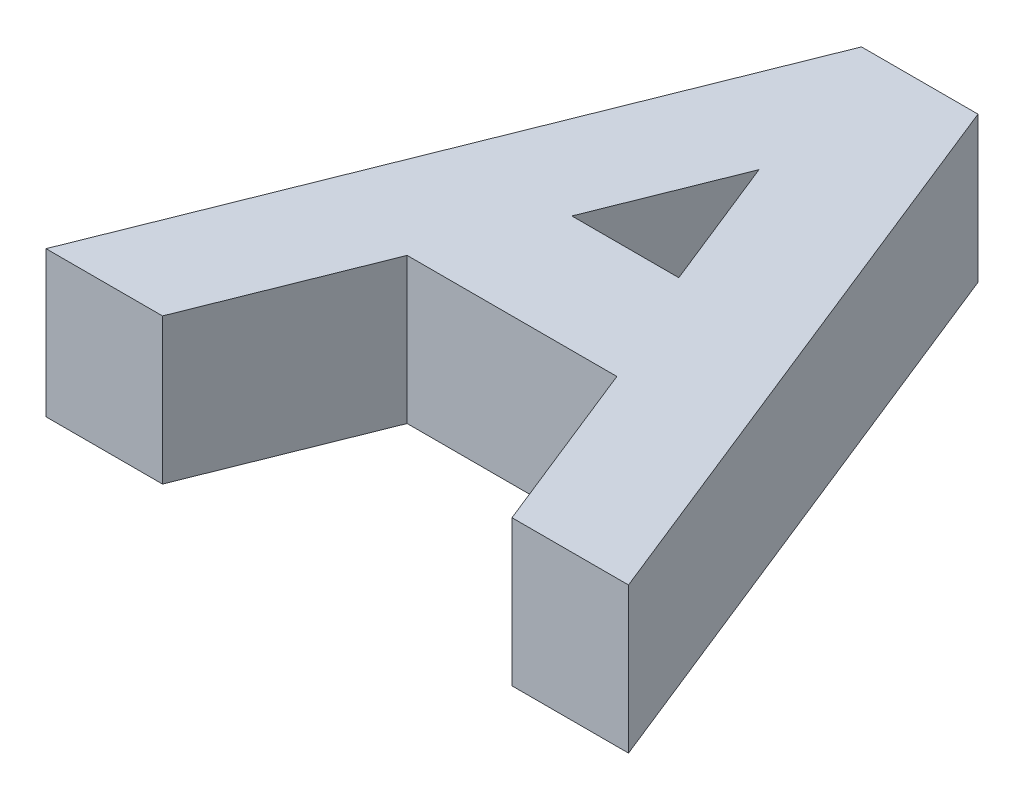
ISO-10303-21;
HEADER;
FILE_DESCRIPTION(('STEP AP214'),'2;1');
FILE_NAME('part.step','',(''),(''),'','','');
FILE_SCHEMA(('AUTOMOTIVE_DESIGN { 1 0 10303 214 1 1 1 1 }'));
ENDSEC;
DATA;
#1=APPLICATION_CONTEXT('core data for automotive mechanical design processes');
#2=APPLICATION_PROTOCOL_DEFINITION('international standard','automotive_design',2000,#1);
#3=PRODUCT_CONTEXT('',#1,'mechanical');
#4=PRODUCT('Part','Part','',(#3));
#5=PRODUCT_RELATED_PRODUCT_CATEGORY('part','',(#4));
#6=PRODUCT_DEFINITION_FORMATION('','',#4);
#7=PRODUCT_DEFINITION_CONTEXT('part definition',#1,'design');
#8=PRODUCT_DEFINITION('design','',#6,#7);
#9=PRODUCT_DEFINITION_SHAPE('','',#8);
#10=(LENGTH_UNIT() NAMED_UNIT(*) SI_UNIT(.MILLI.,.METRE.));
#11=(NAMED_UNIT(*) PLANE_ANGLE_UNIT() SI_UNIT($,.RADIAN.));
#12=(NAMED_UNIT(*) SI_UNIT($,.STERADIAN.) SOLID_ANGLE_UNIT());
#13=UNCERTAINTY_MEASURE_WITH_UNIT(LENGTH_MEASURE(1.E-05),#10,'distance_accuracy_value','');
#14=(GEOMETRIC_REPRESENTATION_CONTEXT(3) GLOBAL_UNCERTAINTY_ASSIGNED_CONTEXT((#13)) GLOBAL_UNIT_ASSIGNED_CONTEXT((#10,
#11,#12)) REPRESENTATION_CONTEXT('',''));
#15=CARTESIAN_POINT('',(0.,0.,0.));
#16=DIRECTION('',(0.,0.,1.));
#17=DIRECTION('',(1.,0.,0.));
#18=AXIS2_PLACEMENT_3D('',#15,#16,#17);
#19=CARTESIAN_POINT('',(0.,10.,0.));
#20=DIRECTION('',(0.,-1.,0.));
#21=DIRECTION('',(0.,0.,-1.));
#22=AXIS2_PLACEMENT_3D('',#19,#20,#21);
#23=PLANE('',#22);
#24=DIRECTION('',(1.,0.,0.));
#25=VECTOR('',#24,1.);
#26=CARTESIAN_POINT('',(8.,10.,0.));
#27=LINE('',#26,#25);
#28=CARTESIAN_POINT('',(0.,10.,0.));
#29=VERTEX_POINT('',#28);
#30=CARTESIAN_POINT('',(8.,10.,0.));
#31=VERTEX_POINT('',#30);
#32=EDGE_CURVE('E143',#29,#31,#27,.T.);
#33=ORIENTED_EDGE('',*,*,#32,.T.);
#34=DIRECTION('',(0.371390676354104,0.,-0.928476690885259));
#35=VECTOR('',#34,1.);
#36=CARTESIAN_POINT('',(12.8,10.,-12.));
#37=LINE('',#36,#35);
#38=CARTESIAN_POINT('',(12.8,10.,-12.));
#39=VERTEX_POINT('',#38);
#40=EDGE_CURVE('E146',#31,#39,#37,.T.);
#41=ORIENTED_EDGE('',*,*,#40,.T.);
#42=DIRECTION('',(1.,0.,0.));
#43=VECTOR('',#42,1.);
#44=CARTESIAN_POINT('',(27.2,10.,-12.));
#45=LINE('',#44,#43);
#46=CARTESIAN_POINT('',(27.2,10.,-12.));
#47=VERTEX_POINT('',#46);
#48=EDGE_CURVE('E149',#39,#47,#45,.T.);
#49=ORIENTED_EDGE('',*,*,#48,.T.);
#50=DIRECTION('',(0.371390676354104,0.,0.928476690885259));
#51=VECTOR('',#50,1.);
#52=CARTESIAN_POINT('',(32.,10.,0.));
#53=LINE('',#52,#51);
#54=CARTESIAN_POINT('',(32.,10.,0.));
#55=VERTEX_POINT('',#54);
#56=EDGE_CURVE('E151',#47,#55,#53,.T.);
#57=ORIENTED_EDGE('',*,*,#56,.T.);
#58=DIRECTION('',(1.,0.,0.));
#59=VECTOR('',#58,1.);
#60=CARTESIAN_POINT('',(40.,10.,0.));
#61=LINE('',#60,#59);
#62=CARTESIAN_POINT('',(40.,10.,0.));
#63=VERTEX_POINT('',#62);
#64=EDGE_CURVE('E153',#55,#63,#61,.T.);
#65=ORIENTED_EDGE('',*,*,#64,.T.);
#66=DIRECTION('',(-0.371390676354104,0.,-0.928476690885259));
#67=VECTOR('',#66,1.);
#68=CARTESIAN_POINT('',(24.,10.,-40.));
#69=LINE('',#68,#67);
#70=CARTESIAN_POINT('',(24.,10.,-40.));
#71=VERTEX_POINT('',#70);
#72=EDGE_CURVE('E155',#63,#71,#69,.T.);
#73=ORIENTED_EDGE('',*,*,#72,.T.);
#74=DIRECTION('',(-1.,0.,0.));
#75=VECTOR('',#74,1.);
#76=CARTESIAN_POINT('',(16.,10.,-40.));
#77=LINE('',#76,#75);
#78=CARTESIAN_POINT('',(16.,10.,-40.));
#79=VERTEX_POINT('',#78);
#80=EDGE_CURVE('E157',#71,#79,#77,.T.);
#81=ORIENTED_EDGE('',*,*,#80,.T.);
#82=DIRECTION('',(-0.371390676354104,0.,0.928476690885259));
#83=VECTOR('',#82,1.);
#84=CARTESIAN_POINT('',(0.,10.,0.));
#85=LINE('',#84,#83);
#86=EDGE_CURVE('E159',#79,#29,#85,.T.);
#87=ORIENTED_EDGE('',*,*,#86,.T.);
#88=EDGE_LOOP('',(#33,#41,#49,#57,#65,#73,#81,#87));
#89=FACE_BOUND('',#88,.T.);
#90=DIRECTION('',(1.,0.,0.));
#91=VECTOR('',#90,1.);
#92=CARTESIAN_POINT('',(23.4532974991233,10.,-20.));
#93=LINE('',#92,#91);
#94=CARTESIAN_POINT('',(16.1105988832336,10.,-20.));
#95=VERTEX_POINT('',#94);
#96=CARTESIAN_POINT('',(23.4532974991233,10.,-20.));
#97=VERTEX_POINT('',#96);
#98=EDGE_CURVE('E116',#95,#97,#93,.T.);
#99=ORIENTED_EDGE('',*,*,#98,.F.);
#100=DIRECTION('',(-0.371390676354103,0.,0.928476690885259));
#101=VECTOR('',#100,1.);
#102=CARTESIAN_POINT('',(16.1105988832336,10.,-20.));
#103=LINE('',#102,#101);
#104=CARTESIAN_POINT('',(19.7819481911784,10.,-29.178373269862));
#105=VERTEX_POINT('',#104);
#106=EDGE_CURVE('E133',#105,#95,#103,.T.);
#107=ORIENTED_EDGE('',*,*,#106,.F.);
#108=DIRECTION('',(-0.371390676354104,0.,-0.928476690885259));
#109=VECTOR('',#108,1.);
#110=CARTESIAN_POINT('',(19.7819481911784,10.,-29.178373269862));
#111=LINE('',#110,#109);
#112=EDGE_CURVE('E124',#97,#105,#111,.T.);
#113=ORIENTED_EDGE('',*,*,#112,.F.);
#114=EDGE_LOOP('',(#99,#107,#113));
#115=FACE_BOUND('',#114,.T.);
#116=ADVANCED_FACE('F33',(#89,#115),#23,.F.);
#117=CARTESIAN_POINT('',(0.,0.,0.));
#118=DIRECTION('',(0.,-1.,0.));
#119=DIRECTION('',(0.,0.,-1.));
#120=AXIS2_PLACEMENT_3D('',#117,#118,#119);
#121=PLANE('',#120);
#122=DIRECTION('',(1.,0.,0.));
#123=VECTOR('',#122,1.);
#124=CARTESIAN_POINT('',(8.,0.,0.));
#125=LINE('',#124,#123);
#126=CARTESIAN_POINT('',(0.,0.,0.));
#127=VERTEX_POINT('',#126);
#128=CARTESIAN_POINT('',(8.,0.,0.));
#129=VERTEX_POINT('',#128);
#130=EDGE_CURVE('E131',#127,#129,#125,.T.);
#131=ORIENTED_EDGE('',*,*,#130,.F.);
#132=DIRECTION('',(-0.371390676354104,0.,0.928476690885259));
#133=VECTOR('',#132,1.);
#134=CARTESIAN_POINT('',(0.,0.,0.));
#135=LINE('',#134,#133);
#136=CARTESIAN_POINT('',(16.,0.,-40.));
#137=VERTEX_POINT('',#136);
#138=EDGE_CURVE('E147',#137,#127,#135,.T.);
#139=ORIENTED_EDGE('',*,*,#138,.F.);
#140=DIRECTION('',(-1.,0.,0.));
#141=VECTOR('',#140,1.);
#142=CARTESIAN_POINT('',(16.,0.,-40.));
#143=LINE('',#142,#141);
#144=CARTESIAN_POINT('',(24.,0.,-40.));
#145=VERTEX_POINT('',#144);
#146=EDGE_CURVE('E174',#145,#137,#143,.T.);
#147=ORIENTED_EDGE('',*,*,#146,.F.);
#148=DIRECTION('',(-0.371390676354104,0.,-0.928476690885259));
#149=VECTOR('',#148,1.);
#150=CARTESIAN_POINT('',(24.,0.,-40.));
#151=LINE('',#150,#149);
#152=CARTESIAN_POINT('',(40.,0.,0.));
#153=VERTEX_POINT('',#152);
#154=EDGE_CURVE('E172',#153,#145,#151,.T.);
#155=ORIENTED_EDGE('',*,*,#154,.F.);
#156=DIRECTION('',(1.,0.,0.));
#157=VECTOR('',#156,1.);
#158=CARTESIAN_POINT('',(40.,0.,0.));
#159=LINE('',#158,#157);
#160=CARTESIAN_POINT('',(32.,0.,0.));
#161=VERTEX_POINT('',#160);
#162=EDGE_CURVE('E170',#161,#153,#159,.T.);
#163=ORIENTED_EDGE('',*,*,#162,.F.);
#164=DIRECTION('',(0.371390676354104,0.,0.928476690885259));
#165=VECTOR('',#164,1.);
#166=CARTESIAN_POINT('',(32.,0.,0.));
#167=LINE('',#166,#165);
#168=CARTESIAN_POINT('',(27.2,0.,-12.));
#169=VERTEX_POINT('',#168);
#170=EDGE_CURVE('E168',#169,#161,#167,.T.);
#171=ORIENTED_EDGE('',*,*,#170,.F.);
#172=DIRECTION('',(1.,0.,0.));
#173=VECTOR('',#172,1.);
#174=CARTESIAN_POINT('',(27.2,0.,-12.));
#175=LINE('',#174,#173);
#176=CARTESIAN_POINT('',(12.8,0.,-12.));
#177=VERTEX_POINT('',#176);
#178=EDGE_CURVE('E166',#177,#169,#175,.T.);
#179=ORIENTED_EDGE('',*,*,#178,.F.);
#180=DIRECTION('',(0.371390676354104,0.,-0.928476690885259));
#181=VECTOR('',#180,1.);
#182=CARTESIAN_POINT('',(12.8,0.,-12.));
#183=LINE('',#182,#181);
#184=EDGE_CURVE('E164',#129,#177,#183,.T.);
#185=ORIENTED_EDGE('',*,*,#184,.F.);
#186=EDGE_LOOP('',(#131,#139,#147,#155,#163,#171,#179,#185));
#187=FACE_BOUND('',#186,.T.);
#188=DIRECTION('',(-0.371390676354103,0.,0.928476690885259));
#189=VECTOR('',#188,1.);
#190=CARTESIAN_POINT('',(16.1105988832336,0.,-20.));
#191=LINE('',#190,#189);
#192=CARTESIAN_POINT('',(19.7819481911784,0.,-29.178373269862));
#193=VERTEX_POINT('',#192);
#194=CARTESIAN_POINT('',(16.1105988832336,0.,-20.));
#195=VERTEX_POINT('',#194);
#196=EDGE_CURVE('E125',#193,#195,#191,.T.);
#197=ORIENTED_EDGE('',*,*,#196,.T.);
#198=DIRECTION('',(1.,0.,0.));
#199=VECTOR('',#198,1.);
#200=CARTESIAN_POINT('',(23.4532974991233,0.,-20.));
#201=LINE('',#200,#199);
#202=CARTESIAN_POINT('',(23.4532974991233,0.,-20.));
#203=VERTEX_POINT('',#202);
#204=EDGE_CURVE('E56',#195,#203,#201,.T.);
#205=ORIENTED_EDGE('',*,*,#204,.T.);
#206=DIRECTION('',(-0.371390676354104,0.,-0.928476690885259));
#207=VECTOR('',#206,1.);
#208=CARTESIAN_POINT('',(19.7819481911784,0.,-29.178373269862));
#209=LINE('',#208,#207);
#210=EDGE_CURVE('E130',#203,#193,#209,.T.);
#211=ORIENTED_EDGE('',*,*,#210,.T.);
#212=EDGE_LOOP('',(#197,#205,#211));
#213=FACE_BOUND('',#212,.T.);
#214=ADVANCED_FACE('F204',(#187,#213),#121,.T.);
#215=CARTESIAN_POINT('',(8.,10.,0.));
#216=DIRECTION('',(0.,0.,-1.));
#217=DIRECTION('',(-1.,0.,0.));
#218=AXIS2_PLACEMENT_3D('',#215,#216,#217);
#219=PLANE('',#218);
#220=ORIENTED_EDGE('',*,*,#130,.T.);
#221=DIRECTION('',(0.,-1.,0.));
#222=VECTOR('',#221,1.);
#223=CARTESIAN_POINT('',(8.,10.,0.));
#224=LINE('',#223,#222);
#225=EDGE_CURVE('E11',#31,#129,#224,.T.);
#226=ORIENTED_EDGE('',*,*,#225,.F.);
#227=ORIENTED_EDGE('',*,*,#32,.F.);
#228=DIRECTION('',(0.,-1.,0.));
#229=VECTOR('',#228,1.);
#230=CARTESIAN_POINT('',(0.,10.,0.));
#231=LINE('',#230,#229);
#232=EDGE_CURVE('E161',#29,#127,#231,.T.);
#233=ORIENTED_EDGE('',*,*,#232,.T.);
#234=EDGE_LOOP('',(#220,#226,#227,#233));
#235=FACE_BOUND('',#234,.T.);
#236=ADVANCED_FACE('F35',(#235),#219,.F.);
#237=CARTESIAN_POINT('',(12.8,10.,-12.));
#238=DIRECTION('',(-0.928476690885259,0.,-0.371390676354104));
#239=DIRECTION('',(-0.371390676354104,0.,0.928476690885259));
#240=AXIS2_PLACEMENT_3D('',#237,#238,#239);
#241=PLANE('',#240);
#242=ORIENTED_EDGE('',*,*,#184,.T.);
#243=DIRECTION('',(0.,-1.,0.));
#244=VECTOR('',#243,1.);
#245=CARTESIAN_POINT('',(12.8,10.,-12.));
#246=LINE('',#245,#244);
#247=EDGE_CURVE('E41',#39,#177,#246,.T.);
#248=ORIENTED_EDGE('',*,*,#247,.F.);
#249=ORIENTED_EDGE('',*,*,#40,.F.);
#250=ORIENTED_EDGE('',*,*,#225,.T.);
#251=EDGE_LOOP('',(#242,#248,#249,#250));
#252=FACE_BOUND('',#251,.T.);
#253=ADVANCED_FACE('F221',(#252),#241,.F.);
#254=CARTESIAN_POINT('',(27.2,10.,-12.));
#255=DIRECTION('',(0.,0.,-1.));
#256=DIRECTION('',(-1.,0.,0.));
#257=AXIS2_PLACEMENT_3D('',#254,#255,#256);
#258=PLANE('',#257);
#259=ORIENTED_EDGE('',*,*,#178,.T.);
#260=DIRECTION('',(0.,-1.,0.));
#261=VECTOR('',#260,1.);
#262=CARTESIAN_POINT('',(27.2,10.,-12.));
#263=LINE('',#262,#261);
#264=EDGE_CURVE('E191',#47,#169,#263,.T.);
#265=ORIENTED_EDGE('',*,*,#264,.F.);
#266=ORIENTED_EDGE('',*,*,#48,.F.);
#267=ORIENTED_EDGE('',*,*,#247,.T.);
#268=EDGE_LOOP('',(#259,#265,#266,#267));
#269=FACE_BOUND('',#268,.T.);
#270=ADVANCED_FACE('F198',(#269),#258,.F.);
#271=CARTESIAN_POINT('',(32.,10.,0.));
#272=DIRECTION('',(0.928476690885259,0.,-0.371390676354104));
#273=DIRECTION('',(-0.371390676354104,0.,-0.928476690885259));
#274=AXIS2_PLACEMENT_3D('',#271,#272,#273);
#275=PLANE('',#274);
#276=ORIENTED_EDGE('',*,*,#170,.T.);
#277=DIRECTION('',(0.,-1.,0.));
#278=VECTOR('',#277,1.);
#279=CARTESIAN_POINT('',(32.,10.,0.));
#280=LINE('',#279,#278);
#281=EDGE_CURVE('E188',#55,#161,#280,.T.);
#282=ORIENTED_EDGE('',*,*,#281,.F.);
#283=ORIENTED_EDGE('',*,*,#56,.F.);
#284=ORIENTED_EDGE('',*,*,#264,.T.);
#285=EDGE_LOOP('',(#276,#282,#283,#284));
#286=FACE_BOUND('',#285,.T.);
#287=ADVANCED_FACE('F210',(#286),#275,.F.);
#288=CARTESIAN_POINT('',(40.,10.,0.));
#289=DIRECTION('',(0.,0.,-1.));
#290=DIRECTION('',(-1.,0.,0.));
#291=AXIS2_PLACEMENT_3D('',#288,#289,#290);
#292=PLANE('',#291);
#293=ORIENTED_EDGE('',*,*,#162,.T.);
#294=DIRECTION('',(0.,-1.,0.));
#295=VECTOR('',#294,1.);
#296=CARTESIAN_POINT('',(40.,10.,0.));
#297=LINE('',#296,#295);
#298=EDGE_CURVE('E185',#63,#153,#297,.T.);
#299=ORIENTED_EDGE('',*,*,#298,.F.);
#300=ORIENTED_EDGE('',*,*,#64,.F.);
#301=ORIENTED_EDGE('',*,*,#281,.T.);
#302=EDGE_LOOP('',(#293,#299,#300,#301));
#303=FACE_BOUND('',#302,.T.);
#304=ADVANCED_FACE('F214',(#303),#292,.F.);
#305=CARTESIAN_POINT('',(24.,10.,-40.));
#306=DIRECTION('',(-0.928476690885259,0.,0.371390676354104));
#307=DIRECTION('',(0.371390676354104,0.,0.928476690885259));
#308=AXIS2_PLACEMENT_3D('',#305,#306,#307);
#309=PLANE('',#308);
#310=ORIENTED_EDGE('',*,*,#154,.T.);
#311=DIRECTION('',(0.,-1.,0.));
#312=VECTOR('',#311,1.);
#313=CARTESIAN_POINT('',(24.,10.,-40.));
#314=LINE('',#313,#312);
#315=EDGE_CURVE('E182',#71,#145,#314,.T.);
#316=ORIENTED_EDGE('',*,*,#315,.F.);
#317=ORIENTED_EDGE('',*,*,#72,.F.);
#318=ORIENTED_EDGE('',*,*,#298,.T.);
#319=EDGE_LOOP('',(#310,#316,#317,#318));
#320=FACE_BOUND('',#319,.T.);
#321=ADVANCED_FACE('F234',(#320),#309,.F.);
#322=CARTESIAN_POINT('',(16.,10.,-40.));
#323=DIRECTION('',(0.,0.,1.));
#324=DIRECTION('',(1.,0.,0.));
#325=AXIS2_PLACEMENT_3D('',#322,#323,#324);
#326=PLANE('',#325);
#327=ORIENTED_EDGE('',*,*,#146,.T.);
#328=DIRECTION('',(0.,-1.,0.));
#329=VECTOR('',#328,1.);
#330=CARTESIAN_POINT('',(16.,10.,-40.));
#331=LINE('',#330,#329);
#332=EDGE_CURVE('E179',#79,#137,#331,.T.);
#333=ORIENTED_EDGE('',*,*,#332,.F.);
#334=ORIENTED_EDGE('',*,*,#80,.F.);
#335=ORIENTED_EDGE('',*,*,#315,.T.);
#336=EDGE_LOOP('',(#327,#333,#334,#335));
#337=FACE_BOUND('',#336,.T.);
#338=ADVANCED_FACE('F232',(#337),#326,.F.);
#339=CARTESIAN_POINT('',(0.,10.,0.));
#340=DIRECTION('',(0.928476690885259,0.,0.371390676354104));
#341=DIRECTION('',(0.371390676354104,0.,-0.928476690885259));
#342=AXIS2_PLACEMENT_3D('',#339,#340,#341);
#343=PLANE('',#342);
#344=ORIENTED_EDGE('',*,*,#138,.T.);
#345=ORIENTED_EDGE('',*,*,#232,.F.);
#346=ORIENTED_EDGE('',*,*,#86,.F.);
#347=ORIENTED_EDGE('',*,*,#332,.T.);
#348=EDGE_LOOP('',(#344,#345,#346,#347));
#349=FACE_BOUND('',#348,.T.);
#350=ADVANCED_FACE('F227',(#349),#343,.F.);
#351=CARTESIAN_POINT('',(23.4532974991233,10.,-20.));
#352=DIRECTION('',(0.,0.,-1.));
#353=DIRECTION('',(-1.,0.,0.));
#354=AXIS2_PLACEMENT_3D('',#351,#352,#353);
#355=PLANE('',#354);
#356=ORIENTED_EDGE('',*,*,#204,.F.);
#357=DIRECTION('',(0.,-1.,0.));
#358=VECTOR('',#357,1.);
#359=CARTESIAN_POINT('',(16.1105988832336,10.,-20.));
#360=LINE('',#359,#358);
#361=EDGE_CURVE('E120',#95,#195,#360,.T.);
#362=ORIENTED_EDGE('',*,*,#361,.F.);
#363=ORIENTED_EDGE('',*,*,#98,.T.);
#364=DIRECTION('',(0.,-1.,0.));
#365=VECTOR('',#364,1.);
#366=CARTESIAN_POINT('',(23.4532974991233,10.,-20.));
#367=LINE('',#366,#365);
#368=EDGE_CURVE('E119',#97,#203,#367,.T.);
#369=ORIENTED_EDGE('',*,*,#368,.T.);
#370=EDGE_LOOP('',(#356,#362,#363,#369));
#371=FACE_BOUND('',#370,.T.);
#372=ADVANCED_FACE('F118',(#371),#355,.T.);
#373=CARTESIAN_POINT('',(19.7819481911784,10.,-29.178373269862));
#374=DIRECTION('',(-0.928476690885259,0.,0.371390676354104));
#375=DIRECTION('',(0.371390676354104,0.,0.928476690885259));
#376=AXIS2_PLACEMENT_3D('',#373,#374,#375);
#377=PLANE('',#376);
#378=ORIENTED_EDGE('',*,*,#210,.F.);
#379=ORIENTED_EDGE('',*,*,#368,.F.);
#380=ORIENTED_EDGE('',*,*,#112,.T.);
#381=DIRECTION('',(0.,-1.,0.));
#382=VECTOR('',#381,1.);
#383=CARTESIAN_POINT('',(19.7819481911784,10.,-29.178373269862));
#384=LINE('',#383,#382);
#385=EDGE_CURVE('E48',#105,#193,#384,.T.);
#386=ORIENTED_EDGE('',*,*,#385,.T.);
#387=EDGE_LOOP('',(#378,#379,#380,#386));
#388=FACE_BOUND('',#387,.T.);
#389=ADVANCED_FACE('F128',(#388),#377,.T.);
#390=CARTESIAN_POINT('',(16.1105988832336,10.,-20.));
#391=DIRECTION('',(0.928476690885259,0.,0.371390676354103));
#392=DIRECTION('',(0.371390676354103,0.,-0.928476690885259));
#393=AXIS2_PLACEMENT_3D('',#390,#391,#392);
#394=PLANE('',#393);
#395=ORIENTED_EDGE('',*,*,#196,.F.);
#396=ORIENTED_EDGE('',*,*,#385,.F.);
#397=ORIENTED_EDGE('',*,*,#106,.T.);
#398=ORIENTED_EDGE('',*,*,#361,.T.);
#399=EDGE_LOOP('',(#395,#396,#397,#398));
#400=FACE_BOUND('',#399,.T.);
#401=ADVANCED_FACE('F259',(#400),#394,.T.);
#402=CLOSED_SHELL('',(#116,#214,#236,#253,#270,#287,#304,#321,#338,#350,#372,#389,#401));
#403=MANIFOLD_SOLID_BREP('B2',#402);
#404=ADVANCED_BREP_SHAPE_REPRESENTATION('',(#18,#403),#14);
#405=SHAPE_DEFINITION_REPRESENTATION(#9,#404);
ENDSEC;
END-ISO-10303-21;
